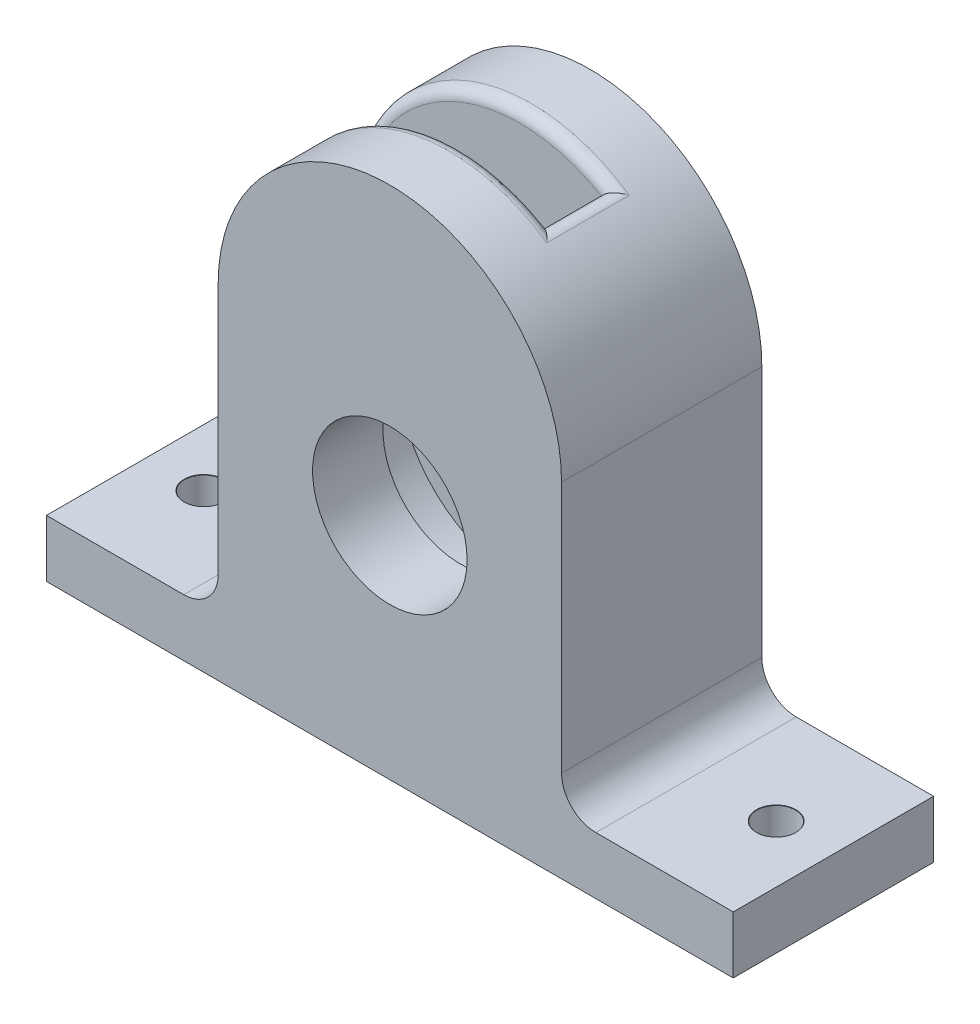
ISO-10303-21;
HEADER;
FILE_DESCRIPTION(('STEP AP214'),'2;1');
FILE_NAME('part.step','',(''),(''),'','','');
FILE_SCHEMA(('AUTOMOTIVE_DESIGN { 1 0 10303 214 1 1 1 1 }'));
ENDSEC;
DATA;
#1=APPLICATION_CONTEXT('core data for automotive mechanical design processes');
#2=APPLICATION_PROTOCOL_DEFINITION('international standard','automotive_design',2000,#1);
#3=PRODUCT_CONTEXT('',#1,'mechanical');
#4=PRODUCT('Part','Part','',(#3));
#5=PRODUCT_RELATED_PRODUCT_CATEGORY('part','',(#4));
#6=PRODUCT_DEFINITION_FORMATION('','',#4);
#7=PRODUCT_DEFINITION_CONTEXT('part definition',#1,'design');
#8=PRODUCT_DEFINITION('design','',#6,#7);
#9=PRODUCT_DEFINITION_SHAPE('','',#8);
#10=(LENGTH_UNIT() NAMED_UNIT(*) SI_UNIT(.MILLI.,.METRE.));
#11=(NAMED_UNIT(*) PLANE_ANGLE_UNIT() SI_UNIT($,.RADIAN.));
#12=(NAMED_UNIT(*) SI_UNIT($,.STERADIAN.) SOLID_ANGLE_UNIT());
#13=UNCERTAINTY_MEASURE_WITH_UNIT(LENGTH_MEASURE(1.E-05),#10,'distance_accuracy_value','');
#14=(GEOMETRIC_REPRESENTATION_CONTEXT(3) GLOBAL_UNCERTAINTY_ASSIGNED_CONTEXT((#13)) GLOBAL_UNIT_ASSIGNED_CONTEXT((#10,
#11,#12)) REPRESENTATION_CONTEXT('',''));
#15=CARTESIAN_POINT('',(0.,0.,0.));
#16=DIRECTION('',(0.,0.,1.));
#17=DIRECTION('',(1.,0.,0.));
#18=AXIS2_PLACEMENT_3D('',#15,#16,#17);
#19=CARTESIAN_POINT('',(-13.873421377159,11.878344827711,8.75));
#20=DIRECTION('',(0.,0.,-1.));
#21=DIRECTION('',(-1.,0.,0.));
#22=AXIS2_PLACEMENT_3D('',#19,#20,#21);
#23=CYLINDRICAL_SURFACE('',#22,1.);
#24=CARTESIAN_POINT('',(-13.7039481017034,12.8638796109157,-2.6));
#25=CARTESIAN_POINT('',(-13.7262347554369,12.867715179815,-2.59999697005028));
#26=CARTESIAN_POINT('',(-13.7486380959221,12.8707855100924,-2.60076675264369));
#27=CARTESIAN_POINT('',(-13.7934816985707,12.8753986820412,-2.60380524962965));
#28=CARTESIAN_POINT('',(-13.8159219134186,12.8769428146898,-2.606072694469));
#29=CARTESIAN_POINT('',(-13.8826386817077,12.8792833699767,-2.61499715030661));
#30=CARTESIAN_POINT('',(-13.9267379946898,12.8778597482602,-2.62377821691352));
#31=CARTESIAN_POINT('',(-14.0129079267345,12.8695149439484,-2.64626487565494));
#32=CARTESIAN_POINT('',(-14.0549842706258,12.8626103781472,-2.65995551457228));
#33=CARTESIAN_POINT('',(-14.1365357385762,12.8440182902506,-2.69143053413603));
#34=CARTESIAN_POINT('',(-14.1760045342964,12.8323195950147,-2.70922443514525));
#35=CARTESIAN_POINT('',(-14.2671686321182,12.7993077235516,-2.75596338401785));
#36=CARTESIAN_POINT('',(-14.3173295463954,12.7760194796267,-2.78650397289579));
#37=CARTESIAN_POINT('',(-14.4109539757246,12.7233044043239,-2.852169021299));
#38=CARTESIAN_POINT('',(-14.4544055673251,12.6938668582192,-2.88730144123303));
#39=CARTESIAN_POINT('',(-14.5488986847121,12.6189835924993,-2.97387849632621));
#40=CARTESIAN_POINT('',(-14.5971346286186,12.5715699121458,-3.02667747027594));
#41=CARTESIAN_POINT('',(-14.6817451462832,12.4707567781567,-3.13589340123868));
#42=CARTESIAN_POINT('',(-14.7181042292072,12.4173496282636,-3.19231496936026));
#43=CARTESIAN_POINT('',(-14.7788067638625,12.3074632561754,-3.30614712182957));
#44=CARTESIAN_POINT('',(-14.8033609892271,12.2510595856529,-3.3635198309139));
#45=CARTESIAN_POINT('',(-14.8416364884941,12.1357163174722,-3.47909931601572));
#46=CARTESIAN_POINT('',(-14.8553813572577,12.0767825410183,-3.5373039914289));
#47=CARTESIAN_POINT('',(-14.8639552607196,12.0156222216822,-3.59696764936085));
#48=CARTESIAN_POINT('',(-14.8641694860519,12.0140674913074,-3.59848384889318));
#49=CARTESIAN_POINT('',(-14.864380046956,12.0125123154047,-3.6));
#50=B_SPLINE_CURVE_WITH_KNOTS('',3,(#24,#25,#26,#27,#28,#29,#30,#31,#32,#33,#34,#35,#36,#37,#38,
#39,#40,#41,#42,#43,#44,#45,#46,#47,#48,#49),.UNSPECIFIED.,.F.,.F.,(4,2,2,2,2,2,2,2,2,2,2,2,4),
(0.,0.0677892638747,0.135521137096125,0.269707441452713,0.403488474507341,0.537583085428258,
0.726069137009201,0.914886393459821,1.17092839575811,1.42730302910178,1.67891241974008,
1.92997105648405,1.93651760257399),.UNSPECIFIED.);
#51=CARTESIAN_POINT('',(-14.864380046956,12.0125123154047,-3.6));
#52=VERTEX_POINT('',#51);
#53=CARTESIAN_POINT('',(-13.7039481017034,12.8638796109157,-2.6));
#54=VERTEX_POINT('',#53);
#55=EDGE_CURVE('E330',#52,#54,#50,.F.);
#56=ORIENTED_EDGE('',*,*,#55,.F.);
#57=DIRECTION('',(0.,0.,-1.));
#58=VECTOR('',#57,1.);
#59=CARTESIAN_POINT('',(-14.864380046956,12.0125123154047,8.75));
#60=LINE('',#59,#58);
#61=CARTESIAN_POINT('',(-14.864380046956,12.0125123154047,3.6));
#62=VERTEX_POINT('',#61);
#63=EDGE_CURVE('E272',#62,#52,#60,.T.);
#64=ORIENTED_EDGE('',*,*,#63,.F.);
#65=CARTESIAN_POINT('',(-13.7039481017034,12.8638796109157,2.6));
#66=CARTESIAN_POINT('',(-13.7262347554369,12.867715179815,2.59999697005028));
#67=CARTESIAN_POINT('',(-13.7486380959221,12.8707855100924,2.60076675264369));
#68=CARTESIAN_POINT('',(-13.7934816985707,12.8753986820412,2.60380524962965));
#69=CARTESIAN_POINT('',(-13.8159219134186,12.8769428146898,2.606072694469));
#70=CARTESIAN_POINT('',(-13.8826386817077,12.8792833699767,2.61499715030661));
#71=CARTESIAN_POINT('',(-13.9267379946898,12.8778597482602,2.62377821691352));
#72=CARTESIAN_POINT('',(-14.0129079267345,12.8695149439484,2.64626487565494));
#73=CARTESIAN_POINT('',(-14.0549842706258,12.8626103781472,2.65995551457228));
#74=CARTESIAN_POINT('',(-14.1365357385762,12.8440182902506,2.69143053413604));
#75=CARTESIAN_POINT('',(-14.1760045342964,12.8323195950147,2.70922443514525));
#76=CARTESIAN_POINT('',(-14.2671686321182,12.7993077235516,2.75596338401785));
#77=CARTESIAN_POINT('',(-14.3173295463954,12.7760194796267,2.78650397289579));
#78=CARTESIAN_POINT('',(-14.4109539757246,12.7233044043239,2.852169021299));
#79=CARTESIAN_POINT('',(-14.4544055673251,12.6938668582192,2.88730144123303));
#80=CARTESIAN_POINT('',(-14.5488986847121,12.6189835924993,2.97387849632621));
#81=CARTESIAN_POINT('',(-14.5971346286186,12.5715699121458,3.02667747027594));
#82=CARTESIAN_POINT('',(-14.6817451462832,12.4707567781567,3.13589340123868));
#83=CARTESIAN_POINT('',(-14.7181042292072,12.4173496282636,3.19231496936026));
#84=CARTESIAN_POINT('',(-14.7788067638625,12.3074632561754,3.30614712182957));
#85=CARTESIAN_POINT('',(-14.8033609892271,12.2510595856529,3.3635198309139));
#86=CARTESIAN_POINT('',(-14.8416364884941,12.1357163174722,3.47909931601572));
#87=CARTESIAN_POINT('',(-14.8553813572577,12.0767825410183,3.5373039914289));
#88=CARTESIAN_POINT('',(-14.8639552607196,12.0156222216822,3.59696764936085));
#89=CARTESIAN_POINT('',(-14.8641694860519,12.0140674913074,3.59848384889318));
#90=CARTESIAN_POINT('',(-14.864380046956,12.0125123154047,3.6));
#91=B_SPLINE_CURVE_WITH_KNOTS('',3,(#65,#66,#67,#68,#69,#70,#71,#72,#73,#74,#75,#76,#77,#78,#79,
#80,#81,#82,#83,#84,#85,#86,#87,#88,#89,#90),.UNSPECIFIED.,.F.,.F.,(4,2,2,2,2,2,2,2,2,2,2,2,4),
(0.,0.0677892638747,0.135521137096125,0.269707441452713,0.403488474507341,0.537583085428258,
0.726069137009201,0.914886393459821,1.17092839575811,1.42730302910178,1.67891241974008,
1.92997105648405,1.93651760257399),.UNSPECIFIED.);
#92=CARTESIAN_POINT('',(-13.7039481017034,12.8638796109157,2.6));
#93=VERTEX_POINT('',#92);
#94=EDGE_CURVE('E338',#62,#93,#91,.F.);
#95=ORIENTED_EDGE('',*,*,#94,.T.);
#96=CARTESIAN_POINT('',(-13.873421377159,11.878344827711,2.6));
#97=DIRECTION('',(0.,0.,1.));
#98=DIRECTION('',(1.,0.,0.));
#99=AXIS2_PLACEMENT_3D('',#96,#97,#98);
#100=CIRCLE('',#99,1.);
#101=CARTESIAN_POINT('',(-12.8886136241468,12.051993005378,2.6));
#102=VERTEX_POINT('',#101);
#103=EDGE_CURVE('E298',#102,#93,#100,.T.);
#104=ORIENTED_EDGE('',*,*,#103,.F.);
#105=DIRECTION('',(0.,0.,1.));
#106=VECTOR('',#105,1.);
#107=CARTESIAN_POINT('',(-12.8886136241467,12.051993005378,8.75));
#108=LINE('',#107,#106);
#109=CARTESIAN_POINT('',(-12.8886136241468,12.051993005378,-2.6));
#110=VERTEX_POINT('',#109);
#111=EDGE_CURVE('E289',#110,#102,#108,.T.);
#112=ORIENTED_EDGE('',*,*,#111,.F.);
#113=CARTESIAN_POINT('',(-13.873421377159,11.878344827711,-2.6));
#114=DIRECTION('',(0.,0.,1.));
#115=DIRECTION('',(1.,0.,0.));
#116=AXIS2_PLACEMENT_3D('',#113,#114,#115);
#117=CIRCLE('',#116,1.);
#118=EDGE_CURVE('E292',#54,#110,#117,.F.);
#119=ORIENTED_EDGE('',*,*,#118,.F.);
#120=EDGE_LOOP('',(#56,#64,#95,#104,#112,#119));
#121=FACE_BOUND('',#120,.T.);
#122=ADVANCED_FACE('F45',(#121),#23,.T.);
#123=CARTESIAN_POINT('',(0.,10.,3.6));
#124=DIRECTION('',(0.,0.,1.));
#125=DIRECTION('',(1.,0.,0.));
#126=AXIS2_PLACEMENT_3D('',#123,#124,#125);
#127=TOROIDAL_SURFACE('',#126,14.,1.);
#128=ORIENTED_EDGE('',*,*,#94,.F.);
#129=CARTESIAN_POINT('',(0.,10.,3.6));
#130=DIRECTION('',(0.,0.,1.));
#131=DIRECTION('',(1.,0.,0.));
#132=AXIS2_PLACEMENT_3D('',#129,#130,#131);
#133=CIRCLE('',#132,15.);
#134=CARTESIAN_POINT('',(8.559016386288,22.3184105508484,3.6));
#135=VERTEX_POINT('',#134);
#136=EDGE_CURVE('E275',#135,#62,#133,.T.);
#137=ORIENTED_EDGE('',*,*,#136,.F.);
#138=CARTESIAN_POINT('',(7.14733322243003,22.0380907044077,2.6));
#139=CARTESIAN_POINT('',(7.15956286422785,22.0571128595147,2.59999697005028));
#140=CARTESIAN_POINT('',(7.17243551172637,22.075704027829,2.60076675264369));
#141=CARTESIAN_POINT('',(7.19933188717216,22.111881576693,2.60380524962965));
#142=CARTESIAN_POINT('',(7.21335463138395,22.1294687945749,2.606072694469));
#143=CARTESIAN_POINT('',(7.25670452310603,22.1802368185435,2.61499715030661));
#144=CARTESIAN_POINT('',(7.287548642102,22.2117870392662,2.62377821691352));
#145=CARTESIAN_POINT('',(7.35191930180125,22.2696775490021,2.64626487565494));
#146=CARTESIAN_POINT('',(7.38543745966749,22.2960332853305,2.65995551457228));
#147=CARTESIAN_POINT('',(7.45424254523323,22.3435955377741,2.69143053413603));
#148=CARTESIAN_POINT('',(7.48953343471047,22.364789839502,2.70922443514525));
#149=CARTESIAN_POINT('',(7.5754639764108,22.4096966139602,2.75596338401785));
#150=CARTESIAN_POINT('',(7.62652307050921,22.4309434616341,2.78650397289579));
#151=CARTESIAN_POINT('',(7.72864198498333,22.4643521467028,2.852169021299));
#152=CARTESIAN_POINT('',(7.77970164898012,22.4764979544496,2.88730144123304));
#153=CARTESIAN_POINT('',(7.89875088568778,22.4955697125679,2.97387849632621));
#154=CARTESIAN_POINT('',(7.96629581133897,22.4990976564436,3.0266774702759));
#155=CARTESIAN_POINT('',(8.09778482396908,22.4933646605673,3.13589340123872));
#156=CARTESIAN_POINT('',(8.16172411900407,22.4840871004788,3.19231496936041));
#157=CARTESIAN_POINT('',(8.28374953274973,22.4545979349337,3.30614712182943));
#158=CARTESIAN_POINT('',(8.34192235502076,22.4345927660834,3.36351983091338));
#159=CARTESIAN_POINT('',(8.4528185991577,22.384882541835,3.47909931601625));
#160=CARTESIAN_POINT('',(8.50555367061962,22.3551988146063,3.53730399143086));
#161=CARTESIAN_POINT('',(8.55643662366946,22.3201985064504,3.59696764936095));
#162=CARTESIAN_POINT('',(8.55772757863485,22.3193060299471,3.59848384889323));
#163=CARTESIAN_POINT('',(8.559016386288,22.3184105508484,3.6));
#164=B_SPLINE_CURVE_WITH_KNOTS('',3,(#138,#139,#140,#141,#142,#143,#144,#145,#146,#147,#148,
#149,#150,#151,#152,#153,#154,#155,#156,#157,#158,#159,#160,#161,#162,#163),.UNSPECIFIED.,.F.,
.F.,(4,2,2,2,2,2,2,2,2,2,2,2,4),(0.,0.0677892638746999,0.135521137096123,0.269707441452713,
0.403488474507336,0.537583085428256,0.726069137009202,0.914886393459822,1.17092839575811,
1.42730302910178,1.67891241974008,1.92997105648405,1.93651760257399),.UNSPECIFIED.);
#165=CARTESIAN_POINT('',(7.14733322243003,22.0380907044077,2.6));
#166=VERTEX_POINT('',#165);
#167=EDGE_CURVE('E310',#135,#166,#164,.F.);
#168=ORIENTED_EDGE('',*,*,#167,.T.);
#169=CARTESIAN_POINT('',(0.,10.,2.6));
#170=DIRECTION('',(0.,0.,1.));
#171=DIRECTION('',(1.,0.,0.));
#172=AXIS2_PLACEMENT_3D('',#169,#170,#171);
#173=CIRCLE('',#172,14.);
#174=EDGE_CURVE('E287',#93,#166,#173,.F.);
#175=ORIENTED_EDGE('',*,*,#174,.F.);
#176=EDGE_LOOP('',(#128,#137,#168,#175));
#177=FACE_BOUND('',#176,.T.);
#178=ADVANCED_FACE('F325',(#177),#127,.T.);
#179=CARTESIAN_POINT('',(7.9884152938688,21.4971831807919,8.75));
#180=DIRECTION('',(0.,0.,-1.));
#181=DIRECTION('',(-1.,0.,0.));
#182=AXIS2_PLACEMENT_3D('',#179,#180,#181);
#183=CYLINDRICAL_SURFACE('',#182,1.);
#184=ORIENTED_EDGE('',*,*,#167,.F.);
#185=DIRECTION('',(0.,0.,-1.));
#186=VECTOR('',#185,1.);
#187=CARTESIAN_POINT('',(8.559016386288,22.3184105508484,8.75));
#188=LINE('',#187,#186);
#189=CARTESIAN_POINT('',(8.559016386288,22.3184105508484,-3.6));
#190=VERTEX_POINT('',#189);
#191=EDGE_CURVE('E278',#190,#135,#188,.F.);
#192=ORIENTED_EDGE('',*,*,#191,.F.);
#193=CARTESIAN_POINT('',(7.14733322243003,22.0380907044077,-2.6));
#194=CARTESIAN_POINT('',(7.15956286422785,22.0571128595147,-2.59999697005028));
#195=CARTESIAN_POINT('',(7.17243551172637,22.075704027829,-2.60076675264369));
#196=CARTESIAN_POINT('',(7.19933188717216,22.111881576693,-2.60380524962965));
#197=CARTESIAN_POINT('',(7.21335463138395,22.1294687945749,-2.606072694469));
#198=CARTESIAN_POINT('',(7.25670452310603,22.1802368185435,-2.61499715030661));
#199=CARTESIAN_POINT('',(7.287548642102,22.2117870392662,-2.62377821691352));
#200=CARTESIAN_POINT('',(7.35191930180125,22.2696775490021,-2.64626487565494));
#201=CARTESIAN_POINT('',(7.38543745966749,22.2960332853305,-2.65995551457227));
#202=CARTESIAN_POINT('',(7.45424254523323,22.3435955377741,-2.69143053413603));
#203=CARTESIAN_POINT('',(7.48953343471047,22.364789839502,-2.70922443514525));
#204=CARTESIAN_POINT('',(7.5754639764108,22.4096966139602,-2.75596338401785));
#205=CARTESIAN_POINT('',(7.62652307050922,22.4309434616341,-2.78650397289579));
#206=CARTESIAN_POINT('',(7.72864198498333,22.4643521467028,-2.85216902129901));
#207=CARTESIAN_POINT('',(7.77970164898012,22.4764979544496,-2.88730144123305));
#208=CARTESIAN_POINT('',(7.89875088568779,22.4955697125679,-2.97387849632619));
#209=CARTESIAN_POINT('',(7.96629581133901,22.4990976564436,-3.02667747027585));
#210=CARTESIAN_POINT('',(8.09778482396903,22.4933646605674,-3.13589340123876));
#211=CARTESIAN_POINT('',(8.16172411900391,22.4840871004789,-3.1923149693606));
#212=CARTESIAN_POINT('',(8.28374953274988,22.4545979349336,-3.30614712182924));
#213=CARTESIAN_POINT('',(8.34192235502131,22.434592766083,-3.36351983091268));
#214=CARTESIAN_POINT('',(8.45281859915714,22.3848825418354,-3.47909931601696));
#215=CARTESIAN_POINT('',(8.50555367061754,22.3551988146077,-3.53730399143347));
#216=CARTESIAN_POINT('',(8.55643662366935,22.3201985064504,-3.59696764936109));
#217=CARTESIAN_POINT('',(8.55772757863479,22.3193060299471,-3.5984838488933));
#218=CARTESIAN_POINT('',(8.559016386288,22.3184105508484,-3.6));
#219=B_SPLINE_CURVE_WITH_KNOTS('',3,(#193,#194,#195,#196,#197,#198,#199,#200,#201,#202,#203,
#204,#205,#206,#207,#208,#209,#210,#211,#212,#213,#214,#215,#216,#217,#218),.UNSPECIFIED.,.F.,
.F.,(4,2,2,2,2,2,2,2,2,2,2,2,4),(0.,0.0677892638746999,0.135521137096123,0.269707441452713,
0.403488474507336,0.537583085428256,0.726069137009205,0.914886393459822,1.1709283957581,
1.42730302910178,1.67891241974009,1.92997105648405,1.93651760257399),.UNSPECIFIED.);
#220=CARTESIAN_POINT('',(7.14733322243003,22.0380907044077,-2.6));
#221=VERTEX_POINT('',#220);
#222=EDGE_CURVE('E301',#190,#221,#219,.F.);
#223=ORIENTED_EDGE('',*,*,#222,.T.);
#224=CARTESIAN_POINT('',(7.9884152938688,21.4971831807919,-2.6));
#225=DIRECTION('',(0.,0.,1.));
#226=DIRECTION('',(1.,0.,0.));
#227=AXIS2_PLACEMENT_3D('',#224,#225,#226);
#228=CIRCLE('',#227,1.);
#229=CARTESIAN_POINT('',(7.00360754085659,21.3235350031249,-2.6));
#230=VERTEX_POINT('',#229);
#231=EDGE_CURVE('E294',#230,#221,#228,.F.);
#232=ORIENTED_EDGE('',*,*,#231,.F.);
#233=DIRECTION('',(0.,0.,1.));
#234=VECTOR('',#233,1.);
#235=CARTESIAN_POINT('',(7.00360754085659,21.3235350031249,8.75));
#236=LINE('',#235,#234);
#237=CARTESIAN_POINT('',(7.00360754085659,21.3235350031249,2.6));
#238=VERTEX_POINT('',#237);
#239=EDGE_CURVE('E187',#238,#230,#236,.F.);
#240=ORIENTED_EDGE('',*,*,#239,.F.);
#241=CARTESIAN_POINT('',(7.9884152938688,21.4971831807919,2.6));
#242=DIRECTION('',(0.,0.,1.));
#243=DIRECTION('',(1.,0.,0.));
#244=AXIS2_PLACEMENT_3D('',#241,#242,#243);
#245=CIRCLE('',#244,1.);
#246=EDGE_CURVE('E296',#166,#238,#245,.T.);
#247=ORIENTED_EDGE('',*,*,#246,.F.);
#248=EDGE_LOOP('',(#184,#192,#223,#232,#240,#247));
#249=FACE_BOUND('',#248,.T.);
#250=ADVANCED_FACE('F317',(#249),#183,.T.);
#251=CARTESIAN_POINT('',(0.,10.,-3.6));
#252=DIRECTION('',(0.,0.,1.));
#253=DIRECTION('',(1.,0.,0.));
#254=AXIS2_PLACEMENT_3D('',#251,#252,#253);
#255=TOROIDAL_SURFACE('',#254,14.,1.);
#256=CARTESIAN_POINT('',(0.,10.,-3.6));
#257=DIRECTION('',(0.,0.,1.));
#258=DIRECTION('',(1.,0.,0.));
#259=AXIS2_PLACEMENT_3D('',#256,#257,#258);
#260=CIRCLE('',#259,15.);
#261=EDGE_CURVE('E281',#52,#190,#260,.F.);
#262=ORIENTED_EDGE('',*,*,#261,.F.);
#263=ORIENTED_EDGE('',*,*,#55,.T.);
#264=CARTESIAN_POINT('',(0.,10.,-2.6));
#265=DIRECTION('',(0.,0.,1.));
#266=DIRECTION('',(1.,0.,0.));
#267=AXIS2_PLACEMENT_3D('',#264,#265,#266);
#268=CIRCLE('',#267,14.);
#269=EDGE_CURVE('E284',#221,#54,#268,.T.);
#270=ORIENTED_EDGE('',*,*,#269,.F.);
#271=ORIENTED_EDGE('',*,*,#222,.F.);
#272=EDGE_LOOP('',(#262,#263,#270,#271));
#273=FACE_BOUND('',#272,.T.);
#274=ADVANCED_FACE('F320',(#273),#255,.T.);
#275=CARTESIAN_POINT('',(0.,10.,8.75));
#276=DIRECTION('',(0.,0.,-1.));
#277=DIRECTION('',(-1.,0.,0.));
#278=AXIS2_PLACEMENT_3D('',#275,#276,#277);
#279=CYLINDRICAL_SURFACE('',#278,15.);
#280=ORIENTED_EDGE('',*,*,#63,.T.);
#281=ORIENTED_EDGE('',*,*,#261,.T.);
#282=ORIENTED_EDGE('',*,*,#191,.T.);
#283=ORIENTED_EDGE('',*,*,#136,.T.);
#284=EDGE_LOOP('',(#280,#281,#282,#283));
#285=FACE_BOUND('',#284,.T.);
#286=CARTESIAN_POINT('',(0.,10.,-8.75));
#287=DIRECTION('',(0.,0.,1.));
#288=DIRECTION('',(1.,0.,0.));
#289=AXIS2_PLACEMENT_3D('',#286,#287,#288);
#290=CIRCLE('',#289,15.);
#291=CARTESIAN_POINT('',(-15.,10.,-8.75));
#292=VERTEX_POINT('',#291);
#293=CARTESIAN_POINT('',(15.,10.,-8.75));
#294=VERTEX_POINT('',#293);
#295=EDGE_CURVE('E237',#292,#294,#290,.F.);
#296=ORIENTED_EDGE('',*,*,#295,.F.);
#297=DIRECTION('',(0.,0.,-1.));
#298=VECTOR('',#297,1.);
#299=CARTESIAN_POINT('',(-15.,10.,8.75));
#300=LINE('',#299,#298);
#301=CARTESIAN_POINT('',(-15.,10.,8.75));
#302=VERTEX_POINT('',#301);
#303=EDGE_CURVE('E266',#302,#292,#300,.T.);
#304=ORIENTED_EDGE('',*,*,#303,.F.);
#305=CARTESIAN_POINT('',(0.,10.,8.75));
#306=DIRECTION('',(0.,0.,1.));
#307=DIRECTION('',(1.,0.,0.));
#308=AXIS2_PLACEMENT_3D('',#305,#306,#307);
#309=CIRCLE('',#308,15.);
#310=CARTESIAN_POINT('',(15.,10.,8.75));
#311=VERTEX_POINT('',#310);
#312=EDGE_CURVE('E214',#302,#311,#309,.F.);
#313=ORIENTED_EDGE('',*,*,#312,.T.);
#314=DIRECTION('',(0.,0.,-1.));
#315=VECTOR('',#314,1.);
#316=CARTESIAN_POINT('',(15.,10.,8.75));
#317=LINE('',#316,#315);
#318=EDGE_CURVE('E269',#311,#294,#317,.T.);
#319=ORIENTED_EDGE('',*,*,#318,.T.);
#320=EDGE_LOOP('',(#296,#304,#313,#319));
#321=FACE_BOUND('',#320,.T.);
#322=ADVANCED_FACE('F323',(#285,#321),#279,.T.);
#323=CARTESIAN_POINT('',(0.,0.,8.75));
#324=DIRECTION('',(0.,0.,-1.));
#325=DIRECTION('',(-1.,0.,0.));
#326=AXIS2_PLACEMENT_3D('',#323,#324,#325);
#327=CYLINDRICAL_SURFACE('',#326,6.75);
#328=CARTESIAN_POINT('',(0.,0.,-8.75));
#329=DIRECTION('',(0.,0.,1.));
#330=DIRECTION('',(1.,0.,0.));
#331=AXIS2_PLACEMENT_3D('',#328,#329,#330);
#332=CIRCLE('',#331,6.75);
#333=CARTESIAN_POINT('',(6.75,0.,-8.75));
#334=VERTEX_POINT('',#333);
#335=EDGE_CURVE('E215',#334,#334,#332,.T.);
#336=ORIENTED_EDGE('',*,*,#335,.F.);
#337=EDGE_LOOP('',(#336));
#338=FACE_BOUND('',#337,.T.);
#339=CARTESIAN_POINT('',(0.,0.,-2.6));
#340=DIRECTION('',(0.,0.,1.));
#341=DIRECTION('',(1.,0.,0.));
#342=AXIS2_PLACEMENT_3D('',#339,#340,#341);
#343=CIRCLE('',#342,6.75);
#344=CARTESIAN_POINT('',(6.75,0.,-2.6));
#345=VERTEX_POINT('',#344);
#346=EDGE_CURVE('E194',#345,#345,#343,.T.);
#347=ORIENTED_EDGE('',*,*,#346,.T.);
#348=EDGE_LOOP('',(#347));
#349=FACE_BOUND('',#348,.T.);
#350=ADVANCED_FACE('F423',(#338,#349),#327,.F.);
#351=CARTESIAN_POINT('',(15.,0.,8.75));
#352=DIRECTION('',(-1.,0.,0.));
#353=DIRECTION('',(0.,0.,1.));
#354=AXIS2_PLACEMENT_3D('',#351,#352,#353);
#355=PLANE('',#354);
#356=DIRECTION('',(0.,1.,0.));
#357=VECTOR('',#356,1.);
#358=CARTESIAN_POINT('',(15.,0.,8.75));
#359=LINE('',#358,#357);
#360=CARTESIAN_POINT('',(15.,-12.,8.75));
#361=VERTEX_POINT('',#360);
#362=EDGE_CURVE('E212',#361,#311,#359,.T.);
#363=ORIENTED_EDGE('',*,*,#362,.F.);
#364=DIRECTION('',(0.,0.,-1.));
#365=VECTOR('',#364,1.);
#366=CARTESIAN_POINT('',(15.,-12.,8.75));
#367=LINE('',#366,#365);
#368=CARTESIAN_POINT('',(15.,-12.,-8.75));
#369=VERTEX_POINT('',#368);
#370=EDGE_CURVE('E337',#361,#369,#367,.T.);
#371=ORIENTED_EDGE('',*,*,#370,.T.);
#372=DIRECTION('',(0.,1.,0.));
#373=VECTOR('',#372,1.);
#374=CARTESIAN_POINT('',(15.,0.,-8.75));
#375=LINE('',#374,#373);
#376=EDGE_CURVE('E210',#369,#294,#375,.T.);
#377=ORIENTED_EDGE('',*,*,#376,.T.);
#378=ORIENTED_EDGE('',*,*,#318,.F.);
#379=EDGE_LOOP('',(#363,#371,#377,#378));
#380=FACE_BOUND('',#379,.T.);
#381=ADVANCED_FACE('F381',(#380),#355,.F.);
#382=CARTESIAN_POINT('',(-15.,0.,8.75));
#383=DIRECTION('',(-1.,0.,0.));
#384=DIRECTION('',(0.,0.,1.));
#385=AXIS2_PLACEMENT_3D('',#382,#383,#384);
#386=PLANE('',#385);
#387=DIRECTION('',(0.,1.,0.));
#388=VECTOR('',#387,1.);
#389=CARTESIAN_POINT('',(-15.,0.,-8.75));
#390=LINE('',#389,#388);
#391=CARTESIAN_POINT('',(-15.,-12.,-8.75));
#392=VERTEX_POINT('',#391);
#393=EDGE_CURVE('E240',#392,#292,#390,.T.);
#394=ORIENTED_EDGE('',*,*,#393,.F.);
#395=DIRECTION('',(0.,0.,-1.));
#396=VECTOR('',#395,1.);
#397=CARTESIAN_POINT('',(-15.,-12.,8.75));
#398=LINE('',#397,#396);
#399=CARTESIAN_POINT('',(-15.,-12.,8.75));
#400=VERTEX_POINT('',#399);
#401=EDGE_CURVE('E60',#392,#400,#398,.F.);
#402=ORIENTED_EDGE('',*,*,#401,.T.);
#403=DIRECTION('',(0.,1.,0.));
#404=VECTOR('',#403,1.);
#405=CARTESIAN_POINT('',(-15.,0.,8.75));
#406=LINE('',#405,#404);
#407=EDGE_CURVE('E218',#400,#302,#406,.T.);
#408=ORIENTED_EDGE('',*,*,#407,.T.);
#409=ORIENTED_EDGE('',*,*,#303,.T.);
#410=EDGE_LOOP('',(#394,#402,#408,#409));
#411=FACE_BOUND('',#410,.T.);
#412=ADVANCED_FACE('F435',(#411),#386,.T.);
#413=CARTESIAN_POINT('',(0.,-15.,8.75));
#414=DIRECTION('',(0.,-1.,0.));
#415=DIRECTION('',(0.,0.,-1.));
#416=AXIS2_PLACEMENT_3D('',#413,#414,#415);
#417=PLANE('',#416);
#418=CARTESIAN_POINT('',(-25.,-15.,0.));
#419=DIRECTION('',(0.,1.,0.));
#420=DIRECTION('',(0.,0.,1.));
#421=AXIS2_PLACEMENT_3D('',#418,#419,#420);
#422=CIRCLE('',#421,1.725);
#423=CARTESIAN_POINT('',(-25.,-15.,1.725));
#424=VERTEX_POINT('',#423);
#425=EDGE_CURVE('E650',#424,#424,#422,.T.);
#426=ORIENTED_EDGE('',*,*,#425,.F.);
#427=EDGE_LOOP('',(#426));
#428=FACE_BOUND('',#427,.T.);
#429=DIRECTION('',(-1.,0.,0.));
#430=VECTOR('',#429,1.);
#431=CARTESIAN_POINT('',(0.,-15.,8.75));
#432=LINE('',#431,#430);
#433=CARTESIAN_POINT('',(-18.,-15.,8.75));
#434=VERTEX_POINT('',#433);
#435=CARTESIAN_POINT('',(-30.,-15.,8.75));
#436=VERTEX_POINT('',#435);
#437=EDGE_CURVE('E220',#434,#436,#432,.T.);
#438=ORIENTED_EDGE('',*,*,#437,.F.);
#439=DIRECTION('',(0.,0.,-1.));
#440=VECTOR('',#439,1.);
#441=CARTESIAN_POINT('',(-18.,-15.,8.75));
#442=LINE('',#441,#440);
#443=CARTESIAN_POINT('',(-18.,-15.,-8.75));
#444=VERTEX_POINT('',#443);
#445=EDGE_CURVE('E375',#434,#444,#442,.T.);
#446=ORIENTED_EDGE('',*,*,#445,.T.);
#447=DIRECTION('',(-1.,0.,0.));
#448=VECTOR('',#447,1.);
#449=CARTESIAN_POINT('',(0.,-15.,-8.75));
#450=LINE('',#449,#448);
#451=CARTESIAN_POINT('',(-30.,-15.,-8.75));
#452=VERTEX_POINT('',#451);
#453=EDGE_CURVE('E242',#444,#452,#450,.T.);
#454=ORIENTED_EDGE('',*,*,#453,.T.);
#455=DIRECTION('',(0.,0.,-1.));
#456=VECTOR('',#455,1.);
#457=CARTESIAN_POINT('',(-30.,-15.,8.75));
#458=LINE('',#457,#456);
#459=EDGE_CURVE('E263',#436,#452,#458,.T.);
#460=ORIENTED_EDGE('',*,*,#459,.F.);
#461=EDGE_LOOP('',(#438,#446,#454,#460));
#462=FACE_BOUND('',#461,.T.);
#463=ADVANCED_FACE('F395',(#428,#462),#417,.F.);
#464=CARTESIAN_POINT('',(-30.,0.,8.75));
#465=DIRECTION('',(-1.,0.,0.));
#466=DIRECTION('',(0.,-1.,0.));
#467=AXIS2_PLACEMENT_3D('',#464,#465,#466);
#468=PLANE('',#467);
#469=DIRECTION('',(0.,1.,0.));
#470=VECTOR('',#469,1.);
#471=CARTESIAN_POINT('',(-30.,0.,-8.75));
#472=LINE('',#471,#470);
#473=CARTESIAN_POINT('',(-30.,-20.,-8.75));
#474=VERTEX_POINT('',#473);
#475=EDGE_CURVE('E244',#474,#452,#472,.T.);
#476=ORIENTED_EDGE('',*,*,#475,.F.);
#477=DIRECTION('',(0.,0.,-1.));
#478=VECTOR('',#477,1.);
#479=CARTESIAN_POINT('',(-30.,-20.,8.75));
#480=LINE('',#479,#478);
#481=CARTESIAN_POINT('',(-30.,-20.,8.75));
#482=VERTEX_POINT('',#481);
#483=EDGE_CURVE('E261',#482,#474,#480,.T.);
#484=ORIENTED_EDGE('',*,*,#483,.F.);
#485=DIRECTION('',(0.,1.,0.));
#486=VECTOR('',#485,1.);
#487=CARTESIAN_POINT('',(-30.,0.,8.75));
#488=LINE('',#487,#486);
#489=EDGE_CURVE('E222',#482,#436,#488,.T.);
#490=ORIENTED_EDGE('',*,*,#489,.T.);
#491=ORIENTED_EDGE('',*,*,#459,.T.);
#492=EDGE_LOOP('',(#476,#484,#490,#491));
#493=FACE_BOUND('',#492,.T.);
#494=ADVANCED_FACE('F401',(#493),#468,.T.);
#495=CARTESIAN_POINT('',(0.,-20.,8.75));
#496=DIRECTION('',(0.,1.,0.));
#497=DIRECTION('',(0.,0.,1.));
#498=AXIS2_PLACEMENT_3D('',#495,#496,#497);
#499=PLANE('',#498);
#500=CARTESIAN_POINT('',(-25.,-20.,0.));
#501=DIRECTION('',(0.,1.,0.));
#502=DIRECTION('',(0.,0.,1.));
#503=AXIS2_PLACEMENT_3D('',#500,#501,#502);
#504=CIRCLE('',#503,1.7);
#505=CARTESIAN_POINT('',(-25.,-20.,1.7));
#506=VERTEX_POINT('',#505);
#507=EDGE_CURVE('E652',#506,#506,#504,.T.);
#508=ORIENTED_EDGE('',*,*,#507,.T.);
#509=EDGE_LOOP('',(#508));
#510=FACE_BOUND('',#509,.T.);
#511=CARTESIAN_POINT('',(25.,-20.,0.));
#512=DIRECTION('',(0.,1.,0.));
#513=DIRECTION('',(0.,0.,1.));
#514=AXIS2_PLACEMENT_3D('',#511,#512,#513);
#515=CIRCLE('',#514,1.7);
#516=CARTESIAN_POINT('',(25.,-20.,1.7));
#517=VERTEX_POINT('',#516);
#518=EDGE_CURVE('E205',#517,#517,#515,.T.);
#519=ORIENTED_EDGE('',*,*,#518,.T.);
#520=EDGE_LOOP('',(#519));
#521=FACE_BOUND('',#520,.T.);
#522=DIRECTION('',(1.,0.,0.));
#523=VECTOR('',#522,1.);
#524=CARTESIAN_POINT('',(0.,-20.,-8.75));
#525=LINE('',#524,#523);
#526=CARTESIAN_POINT('',(30.,-20.,-8.75));
#527=VERTEX_POINT('',#526);
#528=EDGE_CURVE('E247',#474,#527,#525,.T.);
#529=ORIENTED_EDGE('',*,*,#528,.T.);
#530=DIRECTION('',(0.,0.,-1.));
#531=VECTOR('',#530,1.);
#532=CARTESIAN_POINT('',(30.,-20.,8.75));
#533=LINE('',#532,#531);
#534=CARTESIAN_POINT('',(30.,-20.,8.75));
#535=VERTEX_POINT('',#534);
#536=EDGE_CURVE('E258',#535,#527,#533,.T.);
#537=ORIENTED_EDGE('',*,*,#536,.F.);
#538=DIRECTION('',(1.,0.,0.));
#539=VECTOR('',#538,1.);
#540=CARTESIAN_POINT('',(0.,-20.,8.75));
#541=LINE('',#540,#539);
#542=EDGE_CURVE('E225',#482,#535,#541,.T.);
#543=ORIENTED_EDGE('',*,*,#542,.F.);
#544=ORIENTED_EDGE('',*,*,#483,.T.);
#545=EDGE_LOOP('',(#529,#537,#543,#544));
#546=FACE_BOUND('',#545,.T.);
#547=ADVANCED_FACE('F408',(#510,#521,#546),#499,.F.);
#548=CARTESIAN_POINT('',(30.,0.,8.75));
#549=DIRECTION('',(-1.,0.,0.));
#550=DIRECTION('',(0.,-1.,0.));
#551=AXIS2_PLACEMENT_3D('',#548,#549,#550);
#552=PLANE('',#551);
#553=DIRECTION('',(0.,1.,0.));
#554=VECTOR('',#553,1.);
#555=CARTESIAN_POINT('',(30.,0.,-8.75));
#556=LINE('',#555,#554);
#557=CARTESIAN_POINT('',(30.,-15.,-8.75));
#558=VERTEX_POINT('',#557);
#559=EDGE_CURVE('E249',#527,#558,#556,.T.);
#560=ORIENTED_EDGE('',*,*,#559,.T.);
#561=DIRECTION('',(0.,0.,-1.));
#562=VECTOR('',#561,1.);
#563=CARTESIAN_POINT('',(30.,-15.,8.75));
#564=LINE('',#563,#562);
#565=CARTESIAN_POINT('',(30.,-15.,8.75));
#566=VERTEX_POINT('',#565);
#567=EDGE_CURVE('E235',#566,#558,#564,.T.);
#568=ORIENTED_EDGE('',*,*,#567,.F.);
#569=DIRECTION('',(0.,1.,0.));
#570=VECTOR('',#569,1.);
#571=CARTESIAN_POINT('',(30.,0.,8.75));
#572=LINE('',#571,#570);
#573=EDGE_CURVE('E227',#535,#566,#572,.T.);
#574=ORIENTED_EDGE('',*,*,#573,.F.);
#575=ORIENTED_EDGE('',*,*,#536,.T.);
#576=EDGE_LOOP('',(#560,#568,#574,#575));
#577=FACE_BOUND('',#576,.T.);
#578=ADVANCED_FACE('F410',(#577),#552,.F.);
#579=CARTESIAN_POINT('',(0.,-15.,8.75));
#580=DIRECTION('',(0.,1.,0.));
#581=DIRECTION('',(0.,0.,1.));
#582=AXIS2_PLACEMENT_3D('',#579,#580,#581);
#583=PLANE('',#582);
#584=CARTESIAN_POINT('',(25.,-15.,0.));
#585=DIRECTION('',(0.,1.,0.));
#586=DIRECTION('',(0.,0.,1.));
#587=AXIS2_PLACEMENT_3D('',#584,#585,#586);
#588=CIRCLE('',#587,1.725);
#589=CARTESIAN_POINT('',(25.,-15.,1.725));
#590=VERTEX_POINT('',#589);
#591=EDGE_CURVE('E657',#590,#590,#588,.T.);
#592=ORIENTED_EDGE('',*,*,#591,.F.);
#593=EDGE_LOOP('',(#592));
#594=FACE_BOUND('',#593,.T.);
#595=DIRECTION('',(1.,0.,0.));
#596=VECTOR('',#595,1.);
#597=CARTESIAN_POINT('',(0.,-15.,-8.75));
#598=LINE('',#597,#596);
#599=CARTESIAN_POINT('',(18.,-15.,-8.75));
#600=VERTEX_POINT('',#599);
#601=EDGE_CURVE('E252',#600,#558,#598,.T.);
#602=ORIENTED_EDGE('',*,*,#601,.F.);
#603=DIRECTION('',(0.,0.,-1.));
#604=VECTOR('',#603,1.);
#605=CARTESIAN_POINT('',(18.,-15.,8.75));
#606=LINE('',#605,#604);
#607=CARTESIAN_POINT('',(18.,-15.,8.75));
#608=VERTEX_POINT('',#607);
#609=EDGE_CURVE('E365',#600,#608,#606,.F.);
#610=ORIENTED_EDGE('',*,*,#609,.T.);
#611=DIRECTION('',(1.,0.,0.));
#612=VECTOR('',#611,1.);
#613=CARTESIAN_POINT('',(0.,-15.,8.75));
#614=LINE('',#613,#612);
#615=EDGE_CURVE('E230',#608,#566,#614,.T.);
#616=ORIENTED_EDGE('',*,*,#615,.T.);
#617=ORIENTED_EDGE('',*,*,#567,.T.);
#618=EDGE_LOOP('',(#602,#610,#616,#617));
#619=FACE_BOUND('',#618,.T.);
#620=ADVANCED_FACE('F411',(#594,#619),#583,.T.);
#621=CARTESIAN_POINT('',(0.,0.,2.6));
#622=DIRECTION('',(0.,0.,1.));
#623=DIRECTION('',(1.,0.,0.));
#624=AXIS2_PLACEMENT_3D('',#621,#622,#623);
#625=CIRCLE('',#624,6.75);
#626=CARTESIAN_POINT('',(6.75,0.,2.6));
#627=VERTEX_POINT('',#626);
#628=EDGE_CURVE('E202',#627,#627,#625,.T.);
#629=ORIENTED_EDGE('',*,*,#628,.F.);
#630=EDGE_LOOP('',(#629));
#631=FACE_BOUND('',#630,.T.);
#632=CARTESIAN_POINT('',(0.,0.,8.75));
#633=DIRECTION('',(0.,0.,1.));
#634=DIRECTION('',(1.,0.,0.));
#635=AXIS2_PLACEMENT_3D('',#632,#633,#634);
#636=CIRCLE('',#635,6.75);
#637=CARTESIAN_POINT('',(6.75,0.,8.75));
#638=VERTEX_POINT('',#637);
#639=EDGE_CURVE('E232',#638,#638,#636,.T.);
#640=ORIENTED_EDGE('',*,*,#639,.T.);
#641=EDGE_LOOP('',(#640));
#642=FACE_BOUND('',#641,.T.);
#643=ADVANCED_FACE('F413',(#631,#642),#327,.F.);
#644=CARTESIAN_POINT('',(0.,0.,8.75));
#645=DIRECTION('',(0.,0.,1.));
#646=DIRECTION('',(1.,0.,0.));
#647=AXIS2_PLACEMENT_3D('',#644,#645,#646);
#648=PLANE('',#647);
#649=ORIENTED_EDGE('',*,*,#615,.F.);
#650=CARTESIAN_POINT('',(18.,-12.,8.75));
#651=DIRECTION('',(0.,0.,1.));
#652=DIRECTION('',(1.,0.,0.));
#653=AXIS2_PLACEMENT_3D('',#650,#651,#652);
#654=CIRCLE('',#653,3.);
#655=EDGE_CURVE('E364',#608,#361,#654,.F.);
#656=ORIENTED_EDGE('',*,*,#655,.T.);
#657=ORIENTED_EDGE('',*,*,#362,.T.);
#658=ORIENTED_EDGE('',*,*,#312,.F.);
#659=ORIENTED_EDGE('',*,*,#407,.F.);
#660=CARTESIAN_POINT('',(-18.,-12.,8.75));
#661=DIRECTION('',(0.,0.,1.));
#662=DIRECTION('',(1.,0.,0.));
#663=AXIS2_PLACEMENT_3D('',#660,#661,#662);
#664=CIRCLE('',#663,3.);
#665=EDGE_CURVE('E11',#400,#434,#664,.F.);
#666=ORIENTED_EDGE('',*,*,#665,.T.);
#667=ORIENTED_EDGE('',*,*,#437,.T.);
#668=ORIENTED_EDGE('',*,*,#489,.F.);
#669=ORIENTED_EDGE('',*,*,#542,.T.);
#670=ORIENTED_EDGE('',*,*,#573,.T.);
#671=EDGE_LOOP('',(#649,#656,#657,#658,#659,#666,#667,#668,#669,#670));
#672=FACE_BOUND('',#671,.T.);
#673=ORIENTED_EDGE('',*,*,#639,.F.);
#674=EDGE_LOOP('',(#673));
#675=FACE_BOUND('',#674,.T.);
#676=ADVANCED_FACE('F389',(#672,#675),#648,.T.);
#677=CARTESIAN_POINT('',(0.,0.,-8.75));
#678=DIRECTION('',(0.,0.,1.));
#679=DIRECTION('',(1.,0.,0.));
#680=AXIS2_PLACEMENT_3D('',#677,#678,#679);
#681=PLANE('',#680);
#682=ORIENTED_EDGE('',*,*,#376,.F.);
#683=CARTESIAN_POINT('',(18.,-12.,-8.75));
#684=DIRECTION('',(0.,0.,1.));
#685=DIRECTION('',(1.,0.,0.));
#686=AXIS2_PLACEMENT_3D('',#683,#684,#685);
#687=CIRCLE('',#686,3.);
#688=EDGE_CURVE('E370',#369,#600,#687,.T.);
#689=ORIENTED_EDGE('',*,*,#688,.T.);
#690=ORIENTED_EDGE('',*,*,#601,.T.);
#691=ORIENTED_EDGE('',*,*,#559,.F.);
#692=ORIENTED_EDGE('',*,*,#528,.F.);
#693=ORIENTED_EDGE('',*,*,#475,.T.);
#694=ORIENTED_EDGE('',*,*,#453,.F.);
#695=CARTESIAN_POINT('',(-18.,-12.,-8.75));
#696=DIRECTION('',(0.,0.,1.));
#697=DIRECTION('',(1.,0.,0.));
#698=AXIS2_PLACEMENT_3D('',#695,#696,#697);
#699=CIRCLE('',#698,3.);
#700=EDGE_CURVE('E53',#444,#392,#699,.T.);
#701=ORIENTED_EDGE('',*,*,#700,.T.);
#702=ORIENTED_EDGE('',*,*,#393,.T.);
#703=ORIENTED_EDGE('',*,*,#295,.T.);
#704=EDGE_LOOP('',(#682,#689,#690,#691,#692,#693,#694,#701,#702,#703));
#705=FACE_BOUND('',#704,.T.);
#706=ORIENTED_EDGE('',*,*,#335,.T.);
#707=EDGE_LOOP('',(#706));
#708=FACE_BOUND('',#707,.T.);
#709=ADVANCED_FACE('F383',(#705,#708),#681,.F.);
#710=CARTESIAN_POINT('',(0.,0.,-2.6));
#711=DIRECTION('',(0.,0.,1.));
#712=DIRECTION('',(1.,0.,0.));
#713=AXIS2_PLACEMENT_3D('',#710,#711,#712);
#714=CYLINDRICAL_SURFACE('',#713,10.6);
#715=CARTESIAN_POINT('',(0.,0.,2.6));
#716=DIRECTION('',(0.,0.,1.));
#717=DIRECTION('',(1.,0.,0.));
#718=AXIS2_PLACEMENT_3D('',#715,#716,#717);
#719=CIRCLE('',#718,10.6);
#720=CARTESIAN_POINT('',(-10.4389621819294,-1.84067068326947,2.6));
#721=VERTEX_POINT('',#720);
#722=CARTESIAN_POINT('',(10.4389621819294,1.84067068326947,2.6));
#723=VERTEX_POINT('',#722);
#724=EDGE_CURVE('E175',#721,#723,#719,.T.);
#725=ORIENTED_EDGE('',*,*,#724,.T.);
#726=DIRECTION('',(0.,0.,1.));
#727=VECTOR('',#726,1.);
#728=CARTESIAN_POINT('',(10.4389621819294,1.84067068326947,-2.6));
#729=LINE('',#728,#727);
#730=CARTESIAN_POINT('',(10.4389621819294,1.84067068326947,-2.6));
#731=VERTEX_POINT('',#730);
#732=EDGE_CURVE('E168',#731,#723,#729,.T.);
#733=ORIENTED_EDGE('',*,*,#732,.F.);
#734=CARTESIAN_POINT('',(0.,0.,-2.6));
#735=DIRECTION('',(0.,0.,1.));
#736=DIRECTION('',(1.,0.,0.));
#737=AXIS2_PLACEMENT_3D('',#734,#735,#736);
#738=CIRCLE('',#737,10.6);
#739=CARTESIAN_POINT('',(-10.4389621819294,-1.84067068326947,-2.6));
#740=VERTEX_POINT('',#739);
#741=EDGE_CURVE('E173',#740,#731,#738,.T.);
#742=ORIENTED_EDGE('',*,*,#741,.F.);
#743=DIRECTION('',(0.,0.,1.));
#744=VECTOR('',#743,1.);
#745=CARTESIAN_POINT('',(-10.4389621819294,-1.84067068326947,-2.6));
#746=LINE('',#745,#744);
#747=EDGE_CURVE('E179',#740,#721,#746,.T.);
#748=ORIENTED_EDGE('',*,*,#747,.T.);
#749=EDGE_LOOP('',(#725,#733,#742,#748));
#750=FACE_BOUND('',#749,.T.);
#751=ADVANCED_FACE('F170',(#750),#714,.F.);
#752=CARTESIAN_POINT('',(-10.4389621819294,-1.84067068326947,-2.6));
#753=DIRECTION('',(-0.984807753012208,-0.173648177666932,0.));
#754=DIRECTION('',(0.173648177666932,-0.984807753012208,0.));
#755=AXIS2_PLACEMENT_3D('',#752,#753,#754);
#756=PLANE('',#755);
#757=DIRECTION('',(0.173648177666932,-0.984807753012208,0.));
#758=VECTOR('',#757,1.);
#759=CARTESIAN_POINT('',(-10.4389621819294,-1.84067068326947,-2.6));
#760=LINE('',#759,#758);
#761=EDGE_CURVE('E180',#110,#740,#760,.T.);
#762=ORIENTED_EDGE('',*,*,#761,.F.);
#763=ORIENTED_EDGE('',*,*,#111,.T.);
#764=DIRECTION('',(0.173648177666932,-0.984807753012208,0.));
#765=VECTOR('',#764,1.);
#766=CARTESIAN_POINT('',(-10.4389621819294,-1.84067068326947,2.6));
#767=LINE('',#766,#765);
#768=EDGE_CURVE('E197',#102,#721,#767,.T.);
#769=ORIENTED_EDGE('',*,*,#768,.T.);
#770=ORIENTED_EDGE('',*,*,#747,.F.);
#771=EDGE_LOOP('',(#762,#763,#769,#770));
#772=FACE_BOUND('',#771,.T.);
#773=ADVANCED_FACE('F457',(#772),#756,.F.);
#774=CARTESIAN_POINT('',(10.4389621819294,1.84067068326947,-2.6));
#775=DIRECTION('',(0.984807753012208,0.173648177666931,0.));
#776=DIRECTION('',(-0.173648177666931,0.984807753012208,0.));
#777=AXIS2_PLACEMENT_3D('',#774,#775,#776);
#778=PLANE('',#777);
#779=DIRECTION('',(-0.173648177666931,0.984807753012208,0.));
#780=VECTOR('',#779,1.);
#781=CARTESIAN_POINT('',(10.4389621819294,1.84067068326947,2.6));
#782=LINE('',#781,#780);
#783=EDGE_CURVE('E207',#723,#238,#782,.T.);
#784=ORIENTED_EDGE('',*,*,#783,.T.);
#785=ORIENTED_EDGE('',*,*,#239,.T.);
#786=DIRECTION('',(-0.173648177666931,0.984807753012208,0.));
#787=VECTOR('',#786,1.);
#788=CARTESIAN_POINT('',(10.4389621819294,1.84067068326947,-2.6));
#789=LINE('',#788,#787);
#790=EDGE_CURVE('E184',#731,#230,#789,.T.);
#791=ORIENTED_EDGE('',*,*,#790,.F.);
#792=ORIENTED_EDGE('',*,*,#732,.T.);
#793=EDGE_LOOP('',(#784,#785,#791,#792));
#794=FACE_BOUND('',#793,.T.);
#795=ADVANCED_FACE('F185',(#794),#778,.F.);
#796=CARTESIAN_POINT('',(0.,0.,-2.6));
#797=DIRECTION('',(0.,0.,1.));
#798=DIRECTION('',(1.,0.,0.));
#799=AXIS2_PLACEMENT_3D('',#796,#797,#798);
#800=PLANE('',#799);
#801=ORIENTED_EDGE('',*,*,#346,.F.);
#802=EDGE_LOOP('',(#801));
#803=FACE_BOUND('',#802,.T.);
#804=ORIENTED_EDGE('',*,*,#790,.T.);
#805=ORIENTED_EDGE('',*,*,#231,.T.);
#806=ORIENTED_EDGE('',*,*,#269,.T.);
#807=ORIENTED_EDGE('',*,*,#118,.T.);
#808=ORIENTED_EDGE('',*,*,#761,.T.);
#809=ORIENTED_EDGE('',*,*,#741,.T.);
#810=EDGE_LOOP('',(#804,#805,#806,#807,#808,#809));
#811=FACE_BOUND('',#810,.T.);
#812=ADVANCED_FACE('F191',(#803,#811),#800,.T.);
#813=CARTESIAN_POINT('',(0.,0.,2.6));
#814=DIRECTION('',(0.,0.,1.));
#815=DIRECTION('',(1.,0.,0.));
#816=AXIS2_PLACEMENT_3D('',#813,#814,#815);
#817=PLANE('',#816);
#818=ORIENTED_EDGE('',*,*,#628,.T.);
#819=EDGE_LOOP('',(#818));
#820=FACE_BOUND('',#819,.T.);
#821=ORIENTED_EDGE('',*,*,#768,.F.);
#822=ORIENTED_EDGE('',*,*,#103,.T.);
#823=ORIENTED_EDGE('',*,*,#174,.T.);
#824=ORIENTED_EDGE('',*,*,#246,.T.);
#825=ORIENTED_EDGE('',*,*,#783,.F.);
#826=ORIENTED_EDGE('',*,*,#724,.F.);
#827=EDGE_LOOP('',(#821,#822,#823,#824,#825,#826));
#828=FACE_BOUND('',#827,.T.);
#829=ADVANCED_FACE('F350',(#820,#828),#817,.F.);
#830=CARTESIAN_POINT('',(18.,-12.,8.75));
#831=DIRECTION('',(0.,0.,-1.));
#832=DIRECTION('',(-1.,0.,0.));
#833=AXIS2_PLACEMENT_3D('',#830,#831,#832);
#834=CYLINDRICAL_SURFACE('',#833,3.);
#835=ORIENTED_EDGE('',*,*,#655,.F.);
#836=ORIENTED_EDGE('',*,*,#609,.F.);
#837=ORIENTED_EDGE('',*,*,#688,.F.);
#838=ORIENTED_EDGE('',*,*,#370,.F.);
#839=EDGE_LOOP('',(#835,#836,#837,#838));
#840=FACE_BOUND('',#839,.T.);
#841=ADVANCED_FACE('F347',(#840),#834,.F.);
#842=CARTESIAN_POINT('',(-18.,-12.,8.75));
#843=DIRECTION('',(0.,0.,-1.));
#844=DIRECTION('',(-1.,0.,0.));
#845=AXIS2_PLACEMENT_3D('',#842,#843,#844);
#846=CYLINDRICAL_SURFACE('',#845,3.);
#847=ORIENTED_EDGE('',*,*,#665,.F.);
#848=ORIENTED_EDGE('',*,*,#401,.F.);
#849=ORIENTED_EDGE('',*,*,#700,.F.);
#850=ORIENTED_EDGE('',*,*,#445,.F.);
#851=EDGE_LOOP('',(#847,#848,#849,#850));
#852=FACE_BOUND('',#851,.T.);
#853=ADVANCED_FACE('F47',(#852),#846,.F.);
#854=CARTESIAN_POINT('',(25.,-15.,0.));
#855=DIRECTION('',(0.,1.,0.));
#856=DIRECTION('',(0.,0.,1.));
#857=AXIS2_PLACEMENT_3D('',#854,#855,#856);
#858=CYLINDRICAL_SURFACE('',#857,1.7);
#859=ORIENTED_EDGE('',*,*,#518,.F.);
#860=EDGE_LOOP('',(#859));
#861=FACE_BOUND('',#860,.T.);
#862=CARTESIAN_POINT('',(25.,-15.025,0.));
#863=DIRECTION('',(0.,1.,0.));
#864=DIRECTION('',(0.,0.,1.));
#865=AXIS2_PLACEMENT_3D('',#862,#863,#864);
#866=CIRCLE('',#865,1.7);
#867=CARTESIAN_POINT('',(25.,-15.025,1.7));
#868=VERTEX_POINT('',#867);
#869=EDGE_CURVE('E660',#868,#868,#866,.T.);
#870=ORIENTED_EDGE('',*,*,#869,.T.);
#871=EDGE_LOOP('',(#870));
#872=FACE_BOUND('',#871,.T.);
#873=ADVANCED_FACE('F356',(#861,#872),#858,.F.);
#874=CARTESIAN_POINT('',(25.,-15.,0.));
#875=DIRECTION('',(0.,1.,0.));
#876=DIRECTION('',(0.,0.,1.));
#877=AXIS2_PLACEMENT_3D('',#874,#875,#876);
#878=CONICAL_SURFACE('',#877,1.725,0.785398163397414);
#879=ORIENTED_EDGE('',*,*,#869,.F.);
#880=EDGE_LOOP('',(#879));
#881=FACE_BOUND('',#880,.T.);
#882=ORIENTED_EDGE('',*,*,#591,.T.);
#883=EDGE_LOOP('',(#882));
#884=FACE_BOUND('',#883,.T.);
#885=ADVANCED_FACE('F612',(#881,#884),#878,.F.);
#886=CARTESIAN_POINT('',(-25.,-15.,0.));
#887=DIRECTION('',(0.,1.,0.));
#888=DIRECTION('',(0.,0.,1.));
#889=AXIS2_PLACEMENT_3D('',#886,#887,#888);
#890=CYLINDRICAL_SURFACE('',#889,1.7);
#891=ORIENTED_EDGE('',*,*,#507,.F.);
#892=EDGE_LOOP('',(#891));
#893=FACE_BOUND('',#892,.T.);
#894=CARTESIAN_POINT('',(-25.,-15.025,0.));
#895=DIRECTION('',(0.,1.,0.));
#896=DIRECTION('',(0.,0.,1.));
#897=AXIS2_PLACEMENT_3D('',#894,#895,#896);
#898=CIRCLE('',#897,1.7);
#899=CARTESIAN_POINT('',(-25.,-15.025,1.7));
#900=VERTEX_POINT('',#899);
#901=EDGE_CURVE('E647',#900,#900,#898,.T.);
#902=ORIENTED_EDGE('',*,*,#901,.T.);
#903=EDGE_LOOP('',(#902));
#904=FACE_BOUND('',#903,.T.);
#905=ADVANCED_FACE('F620',(#893,#904),#890,.F.);
#906=CARTESIAN_POINT('',(-25.,-15.,0.));
#907=DIRECTION('',(0.,1.,0.));
#908=DIRECTION('',(0.,0.,1.));
#909=AXIS2_PLACEMENT_3D('',#906,#907,#908);
#910=CONICAL_SURFACE('',#909,1.725,0.785398163397414);
#911=ORIENTED_EDGE('',*,*,#901,.F.);
#912=EDGE_LOOP('',(#911));
#913=FACE_BOUND('',#912,.T.);
#914=ORIENTED_EDGE('',*,*,#425,.T.);
#915=EDGE_LOOP('',(#914));
#916=FACE_BOUND('',#915,.T.);
#917=ADVANCED_FACE('F628',(#913,#916),#910,.F.);
#918=CLOSED_SHELL('',(#122,#178,#250,#274,#322,#350,#381,#412,#463,#494,#547,#578,#620,#643,
#676,#709,#751,#773,#795,#812,#829,#841,#853,#873,#885,#905,#917));
#919=MANIFOLD_SOLID_BREP('B2',#918);
#920=ADVANCED_BREP_SHAPE_REPRESENTATION('',(#18,#919),#14);
#921=SHAPE_DEFINITION_REPRESENTATION(#9,#920);
ENDSEC;
END-ISO-10303-21;
